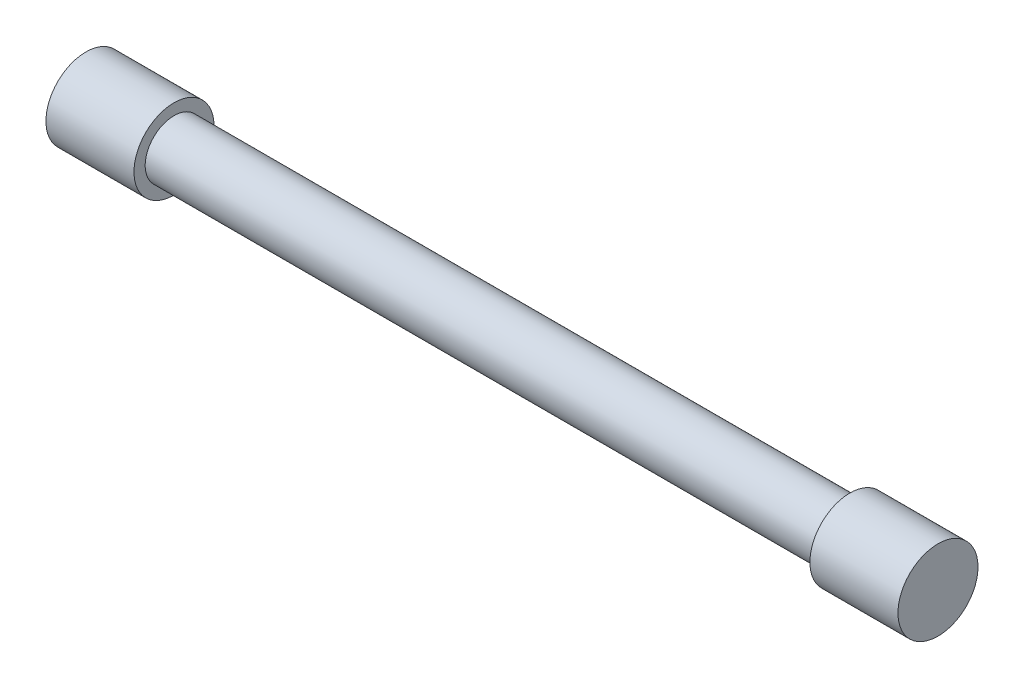
ISO-10303-21;
HEADER;
FILE_DESCRIPTION(('STEP AP214'),'2;1');
FILE_NAME('part.step','',(''),(''),'','','');
FILE_SCHEMA(('AUTOMOTIVE_DESIGN { 1 0 10303 214 1 1 1 1 }'));
ENDSEC;
DATA;
#1=APPLICATION_CONTEXT('core data for automotive mechanical design processes');
#2=APPLICATION_PROTOCOL_DEFINITION('international standard','automotive_design',2000,#1);
#3=PRODUCT_CONTEXT('',#1,'mechanical');
#4=PRODUCT('Part','Part','',(#3));
#5=PRODUCT_RELATED_PRODUCT_CATEGORY('part','',(#4));
#6=PRODUCT_DEFINITION_FORMATION('','',#4);
#7=PRODUCT_DEFINITION_CONTEXT('part definition',#1,'design');
#8=PRODUCT_DEFINITION('design','',#6,#7);
#9=PRODUCT_DEFINITION_SHAPE('','',#8);
#10=(LENGTH_UNIT() NAMED_UNIT(*) SI_UNIT(.MILLI.,.METRE.));
#11=(NAMED_UNIT(*) PLANE_ANGLE_UNIT() SI_UNIT($,.RADIAN.));
#12=(NAMED_UNIT(*) SI_UNIT($,.STERADIAN.) SOLID_ANGLE_UNIT());
#13=UNCERTAINTY_MEASURE_WITH_UNIT(LENGTH_MEASURE(1.E-05),#10,'distance_accuracy_value','');
#14=(GEOMETRIC_REPRESENTATION_CONTEXT(3) GLOBAL_UNCERTAINTY_ASSIGNED_CONTEXT((#13)) GLOBAL_UNIT_ASSIGNED_CONTEXT((#10,
#11,#12)) REPRESENTATION_CONTEXT('',''));
#15=CARTESIAN_POINT('',(0.,0.,0.));
#16=DIRECTION('',(0.,0.,1.));
#17=DIRECTION('',(1.,0.,0.));
#18=AXIS2_PLACEMENT_3D('',#15,#16,#17);
#19=CARTESIAN_POINT('',(266.1,0.,0.));
#20=DIRECTION('',(-1.,0.,0.));
#21=DIRECTION('',(0.,0.,1.));
#22=AXIS2_PLACEMENT_3D('',#19,#20,#21);
#23=CYLINDRICAL_SURFACE('',#22,9.);
#24=CARTESIAN_POINT('',(27.5,0.,0.));
#25=DIRECTION('',(1.,0.,0.));
#26=DIRECTION('',(0.,0.,-1.));
#27=AXIS2_PLACEMENT_3D('',#24,#25,#26);
#28=CIRCLE('',#27,9.);
#29=CARTESIAN_POINT('',(27.5,0.,-9.));
#30=VERTEX_POINT('',#29);
#31=EDGE_CURVE('E56',#30,#30,#28,.T.);
#32=ORIENTED_EDGE('',*,*,#31,.T.);
#33=EDGE_LOOP('',(#32));
#34=FACE_BOUND('',#33,.T.);
#35=CARTESIAN_POINT('',(238.6,0.,0.));
#36=DIRECTION('',(1.,0.,0.));
#37=DIRECTION('',(0.,0.,-1.));
#38=AXIS2_PLACEMENT_3D('',#35,#36,#37);
#39=CIRCLE('',#38,9.);
#40=CARTESIAN_POINT('',(238.6,0.,-9.));
#41=VERTEX_POINT('',#40);
#42=EDGE_CURVE('E10',#41,#41,#39,.T.);
#43=ORIENTED_EDGE('',*,*,#42,.F.);
#44=EDGE_LOOP('',(#43));
#45=FACE_BOUND('',#44,.T.);
#46=ADVANCED_FACE('F37',(#34,#45),#23,.T.);
#47=CARTESIAN_POINT('',(27.5,0.,0.));
#48=DIRECTION('',(1.,0.,0.));
#49=DIRECTION('',(0.,0.,-1.));
#50=AXIS2_PLACEMENT_3D('',#47,#48,#49);
#51=PLANE('',#50);
#52=CARTESIAN_POINT('',(27.5,0.,0.));
#53=DIRECTION('',(1.,0.,0.));
#54=DIRECTION('',(0.,0.,-1.));
#55=AXIS2_PLACEMENT_3D('',#52,#53,#54);
#56=CIRCLE('',#55,12.5);
#57=CARTESIAN_POINT('',(27.5,0.,-12.5));
#58=VERTEX_POINT('',#57);
#59=EDGE_CURVE('E45',#58,#58,#56,.T.);
#60=ORIENTED_EDGE('',*,*,#59,.T.);
#61=EDGE_LOOP('',(#60));
#62=FACE_BOUND('',#61,.T.);
#63=ORIENTED_EDGE('',*,*,#31,.F.);
#64=EDGE_LOOP('',(#63));
#65=FACE_BOUND('',#64,.T.);
#66=ADVANCED_FACE('F85',(#62,#65),#51,.T.);
#67=CARTESIAN_POINT('',(0.,0.,0.));
#68=DIRECTION('',(1.,0.,0.));
#69=DIRECTION('',(0.,0.,-1.));
#70=AXIS2_PLACEMENT_3D('',#67,#68,#69);
#71=PLANE('',#70);
#72=CARTESIAN_POINT('',(0.,0.,0.));
#73=DIRECTION('',(1.,0.,0.));
#74=DIRECTION('',(0.,0.,-1.));
#75=AXIS2_PLACEMENT_3D('',#72,#73,#74);
#76=CIRCLE('',#75,12.5);
#77=CARTESIAN_POINT('',(0.,0.,-12.5));
#78=VERTEX_POINT('',#77);
#79=EDGE_CURVE('E50',#78,#78,#76,.T.);
#80=ORIENTED_EDGE('',*,*,#79,.F.);
#81=EDGE_LOOP('',(#80));
#82=FACE_BOUND('',#81,.T.);
#83=ADVANCED_FACE('F91',(#82),#71,.F.);
#84=CARTESIAN_POINT('',(27.5,0.,0.));
#85=DIRECTION('',(-1.,0.,0.));
#86=DIRECTION('',(0.,0.,1.));
#87=AXIS2_PLACEMENT_3D('',#84,#85,#86);
#88=CYLINDRICAL_SURFACE('',#87,12.5);
#89=ORIENTED_EDGE('',*,*,#59,.F.);
#90=EDGE_LOOP('',(#89));
#91=FACE_BOUND('',#90,.T.);
#92=ORIENTED_EDGE('',*,*,#79,.T.);
#93=EDGE_LOOP('',(#92));
#94=FACE_BOUND('',#93,.T.);
#95=ADVANCED_FACE('F39',(#91,#94),#88,.T.);
#96=CARTESIAN_POINT('',(238.6,0.,0.));
#97=DIRECTION('',(1.,0.,0.));
#98=DIRECTION('',(0.,0.,-1.));
#99=AXIS2_PLACEMENT_3D('',#96,#97,#98);
#100=CYLINDRICAL_SURFACE('',#99,12.5);
#101=CARTESIAN_POINT('',(238.6,0.,0.));
#102=DIRECTION('',(1.,0.,0.));
#103=DIRECTION('',(0.,0.,-1.));
#104=AXIS2_PLACEMENT_3D('',#101,#102,#103);
#105=CIRCLE('',#104,12.5);
#106=CARTESIAN_POINT('',(238.6,0.,-12.5));
#107=VERTEX_POINT('',#106);
#108=EDGE_CURVE('E61',#107,#107,#105,.T.);
#109=ORIENTED_EDGE('',*,*,#108,.T.);
#110=EDGE_LOOP('',(#109));
#111=FACE_BOUND('',#110,.T.);
#112=CARTESIAN_POINT('',(266.1,0.,0.));
#113=DIRECTION('',(1.,0.,0.));
#114=DIRECTION('',(0.,0.,-1.));
#115=AXIS2_PLACEMENT_3D('',#112,#113,#114);
#116=CIRCLE('',#115,12.5);
#117=CARTESIAN_POINT('',(266.1,0.,-12.5));
#118=VERTEX_POINT('',#117);
#119=EDGE_CURVE('E62',#118,#118,#116,.T.);
#120=ORIENTED_EDGE('',*,*,#119,.F.);
#121=EDGE_LOOP('',(#120));
#122=FACE_BOUND('',#121,.T.);
#123=ADVANCED_FACE('F70',(#111,#122),#100,.T.);
#124=CARTESIAN_POINT('',(238.6,0.,0.));
#125=DIRECTION('',(1.,0.,0.));
#126=DIRECTION('',(0.,0.,-1.));
#127=AXIS2_PLACEMENT_3D('',#124,#125,#126);
#128=PLANE('',#127);
#129=ORIENTED_EDGE('',*,*,#42,.T.);
#130=EDGE_LOOP('',(#129));
#131=FACE_BOUND('',#130,.T.);
#132=ORIENTED_EDGE('',*,*,#108,.F.);
#133=EDGE_LOOP('',(#132));
#134=FACE_BOUND('',#133,.T.);
#135=ADVANCED_FACE('F73',(#131,#134),#128,.F.);
#136=CARTESIAN_POINT('',(266.1,0.,0.));
#137=DIRECTION('',(1.,0.,0.));
#138=DIRECTION('',(0.,0.,-1.));
#139=AXIS2_PLACEMENT_3D('',#136,#137,#138);
#140=PLANE('',#139);
#141=ORIENTED_EDGE('',*,*,#119,.T.);
#142=EDGE_LOOP('',(#141));
#143=FACE_BOUND('',#142,.T.);
#144=ADVANCED_FACE('F75',(#143),#140,.T.);
#145=CLOSED_SHELL('',(#46,#66,#83,#95,#123,#135,#144));
#146=MANIFOLD_SOLID_BREP('B2',#145);
#147=ADVANCED_BREP_SHAPE_REPRESENTATION('',(#18,#146),#14);
#148=SHAPE_DEFINITION_REPRESENTATION(#9,#147);
ENDSEC;
END-ISO-10303-21;
